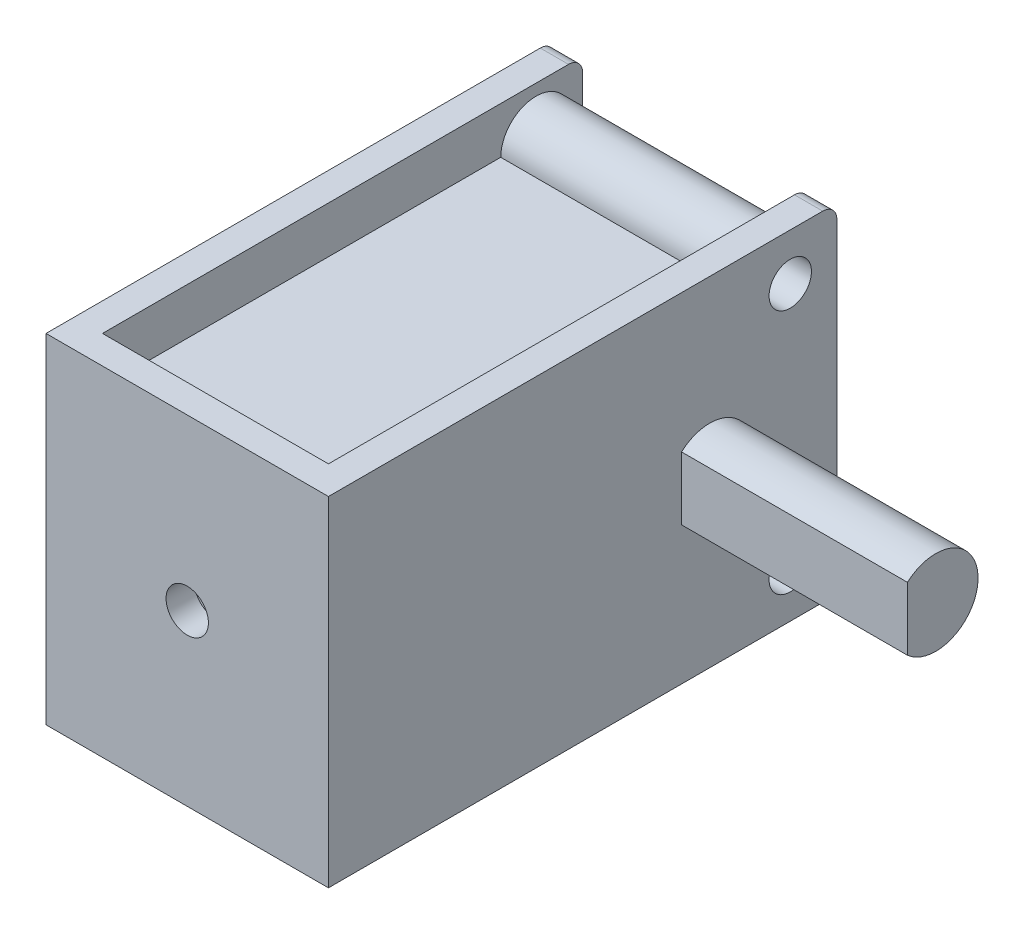
ISO-10303-21;
HEADER;
FILE_DESCRIPTION(('STEP AP214'),'2;1');
FILE_NAME('part.step','',(''),(''),'','','');
FILE_SCHEMA(('AUTOMOTIVE_DESIGN { 1 0 10303 214 1 1 1 1 }'));
ENDSEC;
DATA;
#1=APPLICATION_CONTEXT('core data for automotive mechanical design processes');
#2=APPLICATION_PROTOCOL_DEFINITION('international standard','automotive_design',2000,#1);
#3=PRODUCT_CONTEXT('',#1,'mechanical');
#4=PRODUCT('Part','Part','',(#3));
#5=PRODUCT_RELATED_PRODUCT_CATEGORY('part','',(#4));
#6=PRODUCT_DEFINITION_FORMATION('','',#4);
#7=PRODUCT_DEFINITION_CONTEXT('part definition',#1,'design');
#8=PRODUCT_DEFINITION('design','',#6,#7);
#9=PRODUCT_DEFINITION_SHAPE('','',#8);
#10=(LENGTH_UNIT() NAMED_UNIT(*) SI_UNIT(.MILLI.,.METRE.));
#11=(NAMED_UNIT(*) PLANE_ANGLE_UNIT() SI_UNIT($,.RADIAN.));
#12=(NAMED_UNIT(*) SI_UNIT($,.STERADIAN.) SOLID_ANGLE_UNIT());
#13=UNCERTAINTY_MEASURE_WITH_UNIT(LENGTH_MEASURE(1.E-05),#10,'distance_accuracy_value','');
#14=(GEOMETRIC_REPRESENTATION_CONTEXT(3) GLOBAL_UNCERTAINTY_ASSIGNED_CONTEXT((#13)) GLOBAL_UNIT_ASSIGNED_CONTEXT((#10,
#11,#12)) REPRESENTATION_CONTEXT('',''));
#15=CARTESIAN_POINT('',(0.,0.,0.));
#16=DIRECTION('',(0.,0.,1.));
#17=DIRECTION('',(1.,0.,0.));
#18=AXIS2_PLACEMENT_3D('',#15,#16,#17);
#19=CARTESIAN_POINT('',(4.,-6.,8.));
#20=DIRECTION('',(1.,0.,0.));
#21=DIRECTION('',(0.,0.,-1.));
#22=AXIS2_PLACEMENT_3D('',#19,#20,#21);
#23=PLANE('',#22);
#24=DIRECTION('',(0.,0.,-1.));
#25=VECTOR('',#24,1.);
#26=CARTESIAN_POINT('',(4.,-4.35,8.));
#27=LINE('',#26,#25);
#28=CARTESIAN_POINT('',(4.,-4.35,8.));
#29=VERTEX_POINT('',#28);
#30=CARTESIAN_POINT('',(4.,-4.35,-6.1));
#31=VERTEX_POINT('',#30);
#32=EDGE_CURVE('E726',#29,#31,#27,.T.);
#33=ORIENTED_EDGE('',*,*,#32,.T.);
#34=CARTESIAN_POINT('',(4.,-4.35,-7.35));
#35=DIRECTION('',(1.,0.,0.));
#36=DIRECTION('',(0.,0.,-1.));
#37=AXIS2_PLACEMENT_3D('',#34,#35,#36);
#38=CIRCLE('',#37,1.25);
#39=CARTESIAN_POINT('',(4.,-3.35,-6.6));
#40=VERTEX_POINT('',#39);
#41=EDGE_CURVE('E330',#31,#40,#38,.T.);
#42=ORIENTED_EDGE('',*,*,#41,.T.);
#43=DIRECTION('',(0.,1.,0.));
#44=VECTOR('',#43,1.);
#45=CARTESIAN_POINT('',(4.,4.35,-6.6));
#46=LINE('',#45,#44);
#47=CARTESIAN_POINT('',(4.,3.35,-6.6));
#48=VERTEX_POINT('',#47);
#49=EDGE_CURVE('E77',#40,#48,#46,.T.);
#50=ORIENTED_EDGE('',*,*,#49,.T.);
#51=CARTESIAN_POINT('',(4.,4.35,-7.35));
#52=DIRECTION('',(1.,0.,0.));
#53=DIRECTION('',(0.,0.,-1.));
#54=AXIS2_PLACEMENT_3D('',#51,#52,#53);
#55=CIRCLE('',#54,1.25);
#56=CARTESIAN_POINT('',(4.,4.35,-6.1));
#57=VERTEX_POINT('',#56);
#58=EDGE_CURVE('E329',#48,#57,#55,.T.);
#59=ORIENTED_EDGE('',*,*,#58,.T.);
#60=DIRECTION('',(0.,0.,1.));
#61=VECTOR('',#60,1.);
#62=CARTESIAN_POINT('',(4.,4.35,8.));
#63=LINE('',#62,#61);
#64=CARTESIAN_POINT('',(4.,4.35,8.));
#65=VERTEX_POINT('',#64);
#66=EDGE_CURVE('E69',#57,#65,#63,.T.);
#67=ORIENTED_EDGE('',*,*,#66,.T.);
#68=DIRECTION('',(0.,1.,0.));
#69=VECTOR('',#68,1.);
#70=CARTESIAN_POINT('',(4.,-6.,8.));
#71=LINE('',#70,#69);
#72=CARTESIAN_POINT('',(4.,6.,8.));
#73=VERTEX_POINT('',#72);
#74=EDGE_CURVE('E206',#65,#73,#71,.T.);
#75=ORIENTED_EDGE('',*,*,#74,.T.);
#76=DIRECTION('',(0.,0.,-1.));
#77=VECTOR('',#76,1.);
#78=CARTESIAN_POINT('',(4.,6.,8.));
#79=LINE('',#78,#77);
#80=CARTESIAN_POINT('',(4.,6.,-8.5));
#81=VERTEX_POINT('',#80);
#82=EDGE_CURVE('E353',#73,#81,#79,.T.);
#83=ORIENTED_EDGE('',*,*,#82,.T.);
#84=CARTESIAN_POINT('',(4.,5.5,-8.5));
#85=DIRECTION('',(1.,0.,0.));
#86=DIRECTION('',(0.,0.,-1.));
#87=AXIS2_PLACEMENT_3D('',#84,#85,#86);
#88=CIRCLE('',#87,0.5);
#89=CARTESIAN_POINT('',(4.,5.5,-9.));
#90=VERTEX_POINT('',#89);
#91=EDGE_CURVE('E11',#81,#90,#88,.F.);
#92=ORIENTED_EDGE('',*,*,#91,.T.);
#93=DIRECTION('',(0.,1.,0.));
#94=VECTOR('',#93,1.);
#95=CARTESIAN_POINT('',(4.,-6.,-9.));
#96=LINE('',#95,#94);
#97=CARTESIAN_POINT('',(4.,-5.5,-9.));
#98=VERTEX_POINT('',#97);
#99=EDGE_CURVE('E232',#98,#90,#96,.T.);
#100=ORIENTED_EDGE('',*,*,#99,.F.);
#101=CARTESIAN_POINT('',(4.,-5.5,-8.5));
#102=DIRECTION('',(1.,0.,0.));
#103=DIRECTION('',(0.,0.,-1.));
#104=AXIS2_PLACEMENT_3D('',#101,#102,#103);
#105=CIRCLE('',#104,0.5);
#106=CARTESIAN_POINT('',(4.,-6.,-8.5));
#107=VERTEX_POINT('',#106);
#108=EDGE_CURVE('E231',#98,#107,#105,.F.);
#109=ORIENTED_EDGE('',*,*,#108,.T.);
#110=DIRECTION('',(0.,0.,-1.));
#111=VECTOR('',#110,1.);
#112=CARTESIAN_POINT('',(4.,-6.,8.));
#113=LINE('',#112,#111);
#114=CARTESIAN_POINT('',(4.,-6.,8.));
#115=VERTEX_POINT('',#114);
#116=EDGE_CURVE('E222',#115,#107,#113,.T.);
#117=ORIENTED_EDGE('',*,*,#116,.F.);
#118=EDGE_CURVE('E225',#115,#29,#71,.T.);
#119=ORIENTED_EDGE('',*,*,#118,.T.);
#120=EDGE_LOOP('',(#33,#42,#50,#59,#67,#75,#83,#92,#100,#109,#117,#119));
#121=FACE_BOUND('',#120,.T.);
#122=ADVANCED_FACE('F51',(#121),#23,.F.);
#123=CARTESIAN_POINT('',(-4.,-6.,8.));
#124=DIRECTION('',(0.,0.,1.));
#125=DIRECTION('',(1.,0.,0.));
#126=AXIS2_PLACEMENT_3D('',#123,#124,#125);
#127=PLANE('',#126);
#128=DIRECTION('',(-1.,0.,0.));
#129=VECTOR('',#128,1.);
#130=CARTESIAN_POINT('',(13.002,-4.35,8.));
#131=LINE('',#130,#129);
#132=CARTESIAN_POINT('',(-4.,-4.35,8.));
#133=VERTEX_POINT('',#132);
#134=EDGE_CURVE('E208',#29,#133,#131,.T.);
#135=ORIENTED_EDGE('',*,*,#134,.F.);
#136=ORIENTED_EDGE('',*,*,#118,.F.);
#137=DIRECTION('',(1.,0.,0.));
#138=VECTOR('',#137,1.);
#139=CARTESIAN_POINT('',(-4.,-6.,8.));
#140=LINE('',#139,#138);
#141=CARTESIAN_POINT('',(-4.,-6.,8.));
#142=VERTEX_POINT('',#141);
#143=EDGE_CURVE('E352',#142,#115,#140,.T.);
#144=ORIENTED_EDGE('',*,*,#143,.F.);
#145=DIRECTION('',(0.,1.,0.));
#146=VECTOR('',#145,1.);
#147=CARTESIAN_POINT('',(-4.,-6.,8.));
#148=LINE('',#147,#146);
#149=EDGE_CURVE('E216',#142,#133,#148,.T.);
#150=ORIENTED_EDGE('',*,*,#149,.T.);
#151=EDGE_LOOP('',(#135,#136,#144,#150));
#152=FACE_BOUND('',#151,.T.);
#153=ADVANCED_FACE('F441',(#152),#127,.F.);
#154=DIRECTION('',(-1.,0.,0.));
#155=VECTOR('',#154,1.);
#156=CARTESIAN_POINT('',(13.002,4.35,8.));
#157=LINE('',#156,#155);
#158=CARTESIAN_POINT('',(-4.,4.35,8.));
#159=VERTEX_POINT('',#158);
#160=EDGE_CURVE('E191',#65,#159,#157,.T.);
#161=ORIENTED_EDGE('',*,*,#160,.T.);
#162=CARTESIAN_POINT('',(-4.,6.,8.));
#163=VERTEX_POINT('',#162);
#164=EDGE_CURVE('E204',#159,#163,#148,.T.);
#165=ORIENTED_EDGE('',*,*,#164,.T.);
#166=DIRECTION('',(1.,0.,0.));
#167=VECTOR('',#166,1.);
#168=CARTESIAN_POINT('',(-4.,6.,8.));
#169=LINE('',#168,#167);
#170=EDGE_CURVE('E362',#163,#73,#169,.T.);
#171=ORIENTED_EDGE('',*,*,#170,.T.);
#172=ORIENTED_EDGE('',*,*,#74,.F.);
#173=EDGE_LOOP('',(#161,#165,#171,#172));
#174=FACE_BOUND('',#173,.T.);
#175=ADVANCED_FACE('F202',(#174),#127,.F.);
#176=CARTESIAN_POINT('',(-4.,-6.,-9.));
#177=DIRECTION('',(-1.,0.,0.));
#178=DIRECTION('',(0.,0.,1.));
#179=AXIS2_PLACEMENT_3D('',#176,#177,#178);
#180=PLANE('',#179);
#181=DIRECTION('',(0.,0.,-1.));
#182=VECTOR('',#181,1.);
#183=CARTESIAN_POINT('',(-4.,-4.35,8.));
#184=LINE('',#183,#182);
#185=CARTESIAN_POINT('',(-4.,-4.35,-6.1));
#186=VERTEX_POINT('',#185);
#187=EDGE_CURVE('E747',#133,#186,#184,.T.);
#188=ORIENTED_EDGE('',*,*,#187,.F.);
#189=ORIENTED_EDGE('',*,*,#149,.F.);
#190=DIRECTION('',(0.,0.,1.));
#191=VECTOR('',#190,1.);
#192=CARTESIAN_POINT('',(-4.,-6.,-9.));
#193=LINE('',#192,#191);
#194=CARTESIAN_POINT('',(-4.,-6.,-8.5));
#195=VERTEX_POINT('',#194);
#196=EDGE_CURVE('E348',#195,#142,#193,.T.);
#197=ORIENTED_EDGE('',*,*,#196,.F.);
#198=CARTESIAN_POINT('',(-4.,-5.5,-8.5));
#199=DIRECTION('',(-1.,0.,0.));
#200=DIRECTION('',(0.,0.,1.));
#201=AXIS2_PLACEMENT_3D('',#198,#199,#200);
#202=CIRCLE('',#201,0.5);
#203=CARTESIAN_POINT('',(-4.,-5.5,-9.));
#204=VERTEX_POINT('',#203);
#205=EDGE_CURVE('E228',#195,#204,#202,.F.);
#206=ORIENTED_EDGE('',*,*,#205,.T.);
#207=DIRECTION('',(0.,1.,0.));
#208=VECTOR('',#207,1.);
#209=CARTESIAN_POINT('',(-4.,-6.,-9.));
#210=LINE('',#209,#208);
#211=CARTESIAN_POINT('',(-4.,5.5,-9.));
#212=VERTEX_POINT('',#211);
#213=EDGE_CURVE('E217',#204,#212,#210,.T.);
#214=ORIENTED_EDGE('',*,*,#213,.T.);
#215=CARTESIAN_POINT('',(-4.,5.5,-8.5));
#216=DIRECTION('',(-1.,0.,0.));
#217=DIRECTION('',(0.,0.,1.));
#218=AXIS2_PLACEMENT_3D('',#215,#216,#217);
#219=CIRCLE('',#218,0.5);
#220=CARTESIAN_POINT('',(-4.,6.,-8.5));
#221=VERTEX_POINT('',#220);
#222=EDGE_CURVE('E61',#212,#221,#219,.F.);
#223=ORIENTED_EDGE('',*,*,#222,.T.);
#224=DIRECTION('',(0.,0.,1.));
#225=VECTOR('',#224,1.);
#226=CARTESIAN_POINT('',(-4.,6.,-9.));
#227=LINE('',#226,#225);
#228=EDGE_CURVE('E213',#221,#163,#227,.T.);
#229=ORIENTED_EDGE('',*,*,#228,.T.);
#230=ORIENTED_EDGE('',*,*,#164,.F.);
#231=DIRECTION('',(0.,0.,1.));
#232=VECTOR('',#231,1.);
#233=CARTESIAN_POINT('',(-4.,4.35,8.));
#234=LINE('',#233,#232);
#235=CARTESIAN_POINT('',(-4.,4.35,-6.1));
#236=VERTEX_POINT('',#235);
#237=EDGE_CURVE('E188',#236,#159,#234,.T.);
#238=ORIENTED_EDGE('',*,*,#237,.F.);
#239=CARTESIAN_POINT('',(-4.,4.35,-7.35));
#240=DIRECTION('',(-1.,0.,0.));
#241=DIRECTION('',(0.,0.,1.));
#242=AXIS2_PLACEMENT_3D('',#239,#240,#241);
#243=CIRCLE('',#242,1.25);
#244=CARTESIAN_POINT('',(-4.,3.35,-6.6));
#245=VERTEX_POINT('',#244);
#246=EDGE_CURVE('E327',#236,#245,#243,.T.);
#247=ORIENTED_EDGE('',*,*,#246,.T.);
#248=DIRECTION('',(0.,1.,0.));
#249=VECTOR('',#248,1.);
#250=CARTESIAN_POINT('',(-4.,4.35,-6.6));
#251=LINE('',#250,#249);
#252=CARTESIAN_POINT('',(-4.,-3.35,-6.6));
#253=VERTEX_POINT('',#252);
#254=EDGE_CURVE('E198',#253,#245,#251,.T.);
#255=ORIENTED_EDGE('',*,*,#254,.F.);
#256=CARTESIAN_POINT('',(-4.,-4.35,-7.35));
#257=DIRECTION('',(-1.,0.,0.));
#258=DIRECTION('',(0.,0.,1.));
#259=AXIS2_PLACEMENT_3D('',#256,#257,#258);
#260=CIRCLE('',#259,1.25);
#261=EDGE_CURVE('E55',#253,#186,#260,.T.);
#262=ORIENTED_EDGE('',*,*,#261,.T.);
#263=EDGE_LOOP('',(#188,#189,#197,#206,#214,#223,#229,#230,#238,#247,#255,#262));
#264=FACE_BOUND('',#263,.T.);
#265=ADVANCED_FACE('F211',(#264),#180,.F.);
#266=CARTESIAN_POINT('',(-5.,4.35,-7.35));
#267=DIRECTION('',(1.,0.,0.));
#268=DIRECTION('',(0.,0.,-1.));
#269=AXIS2_PLACEMENT_3D('',#266,#267,#268);
#270=CYLINDRICAL_SURFACE('',#269,1.25);
#271=ORIENTED_EDGE('',*,*,#58,.F.);
#272=DIRECTION('',(1.,0.,0.));
#273=VECTOR('',#272,1.);
#274=CARTESIAN_POINT('',(-5.,3.35,-6.6));
#275=LINE('',#274,#273);
#276=EDGE_CURVE('E732',#245,#48,#275,.T.);
#277=ORIENTED_EDGE('',*,*,#276,.F.);
#278=ORIENTED_EDGE('',*,*,#246,.F.);
#279=DIRECTION('',(1.,0.,0.));
#280=VECTOR('',#279,1.);
#281=CARTESIAN_POINT('',(-5.,4.35,-6.1));
#282=LINE('',#281,#280);
#283=EDGE_CURVE('E192',#57,#236,#282,.F.);
#284=ORIENTED_EDGE('',*,*,#283,.F.);
#285=EDGE_LOOP('',(#271,#277,#278,#284));
#286=FACE_BOUND('',#285,.T.);
#287=ADVANCED_FACE('F449',(#286),#270,.T.);
#288=CARTESIAN_POINT('',(-5.,-4.35,-7.35));
#289=DIRECTION('',(1.,0.,0.));
#290=DIRECTION('',(0.,0.,-1.));
#291=AXIS2_PLACEMENT_3D('',#288,#289,#290);
#292=CYLINDRICAL_SURFACE('',#291,1.25);
#293=ORIENTED_EDGE('',*,*,#41,.F.);
#294=DIRECTION('',(1.,0.,0.));
#295=VECTOR('',#294,1.);
#296=CARTESIAN_POINT('',(-5.,-4.35,-6.1));
#297=LINE('',#296,#295);
#298=EDGE_CURVE('E729',#186,#31,#297,.T.);
#299=ORIENTED_EDGE('',*,*,#298,.F.);
#300=ORIENTED_EDGE('',*,*,#261,.F.);
#301=DIRECTION('',(1.,0.,0.));
#302=VECTOR('',#301,1.);
#303=CARTESIAN_POINT('',(-5.,-3.35,-6.6));
#304=LINE('',#303,#302);
#305=EDGE_CURVE('E735',#40,#253,#304,.F.);
#306=ORIENTED_EDGE('',*,*,#305,.F.);
#307=EDGE_LOOP('',(#293,#299,#300,#306));
#308=FACE_BOUND('',#307,.T.);
#309=ADVANCED_FACE('F548',(#308),#292,.T.);
#310=CARTESIAN_POINT('',(-5.,6.,-9.));
#311=DIRECTION('',(0.,0.,1.));
#312=DIRECTION('',(1.,0.,0.));
#313=AXIS2_PLACEMENT_3D('',#310,#311,#312);
#314=PLANE('',#313);
#315=DIRECTION('',(-1.,0.,0.));
#316=VECTOR('',#315,1.);
#317=CARTESIAN_POINT('',(-5.,-5.5,-9.));
#318=LINE('',#317,#316);
#319=CARTESIAN_POINT('',(5.,-5.5,-9.));
#320=VERTEX_POINT('',#319);
#321=EDGE_CURVE('E300',#320,#98,#318,.T.);
#322=ORIENTED_EDGE('',*,*,#321,.T.);
#323=ORIENTED_EDGE('',*,*,#99,.T.);
#324=DIRECTION('',(-1.,0.,0.));
#325=VECTOR('',#324,1.);
#326=CARTESIAN_POINT('',(-5.,5.5,-9.));
#327=LINE('',#326,#325);
#328=CARTESIAN_POINT('',(5.,5.5,-9.));
#329=VERTEX_POINT('',#328);
#330=EDGE_CURVE('E294',#90,#329,#327,.F.);
#331=ORIENTED_EDGE('',*,*,#330,.T.);
#332=DIRECTION('',(0.,-1.,0.));
#333=VECTOR('',#332,1.);
#334=CARTESIAN_POINT('',(5.,6.,-9.));
#335=LINE('',#334,#333);
#336=EDGE_CURVE('E290',#329,#320,#335,.T.);
#337=ORIENTED_EDGE('',*,*,#336,.T.);
#338=EDGE_LOOP('',(#322,#323,#331,#337));
#339=FACE_BOUND('',#338,.T.);
#340=ADVANCED_FACE('F389',(#339),#314,.F.);
#341=CARTESIAN_POINT('',(-5.,-5.5,-8.5));
#342=DIRECTION('',(1.,0.,0.));
#343=DIRECTION('',(0.,0.,-1.));
#344=AXIS2_PLACEMENT_3D('',#341,#342,#343);
#345=CYLINDRICAL_SURFACE('',#344,0.5);
#346=ORIENTED_EDGE('',*,*,#108,.F.);
#347=ORIENTED_EDGE('',*,*,#321,.F.);
#348=CARTESIAN_POINT('',(5.,-5.5,-8.5));
#349=DIRECTION('',(-1.,0.,0.));
#350=DIRECTION('',(0.,0.,1.));
#351=AXIS2_PLACEMENT_3D('',#348,#349,#350);
#352=CIRCLE('',#351,0.5);
#353=CARTESIAN_POINT('',(5.,-6.,-8.5));
#354=VERTEX_POINT('',#353);
#355=EDGE_CURVE('E318',#354,#320,#352,.F.);
#356=ORIENTED_EDGE('',*,*,#355,.F.);
#357=DIRECTION('',(-1.,0.,0.));
#358=VECTOR('',#357,1.);
#359=CARTESIAN_POINT('',(5.,-6.,-8.5));
#360=LINE('',#359,#358);
#361=EDGE_CURVE('E310',#107,#354,#360,.F.);
#362=ORIENTED_EDGE('',*,*,#361,.F.);
#363=EDGE_LOOP('',(#346,#347,#356,#362));
#364=FACE_BOUND('',#363,.T.);
#365=ADVANCED_FACE('F387',(#364),#345,.T.);
#366=CARTESIAN_POINT('',(0.,5.5,-8.5));
#367=DIRECTION('',(-1.,0.,0.));
#368=DIRECTION('',(0.,0.,1.));
#369=AXIS2_PLACEMENT_3D('',#366,#367,#368);
#370=CYLINDRICAL_SURFACE('',#369,0.5);
#371=ORIENTED_EDGE('',*,*,#91,.F.);
#372=DIRECTION('',(-1.,0.,0.));
#373=VECTOR('',#372,1.);
#374=CARTESIAN_POINT('',(0.,6.,-8.5));
#375=LINE('',#374,#373);
#376=CARTESIAN_POINT('',(5.,6.,-8.5));
#377=VERTEX_POINT('',#376);
#378=EDGE_CURVE('E322',#377,#81,#375,.T.);
#379=ORIENTED_EDGE('',*,*,#378,.F.);
#380=CARTESIAN_POINT('',(5.,5.5,-8.5));
#381=DIRECTION('',(-1.,0.,0.));
#382=DIRECTION('',(0.,0.,1.));
#383=AXIS2_PLACEMENT_3D('',#380,#381,#382);
#384=CIRCLE('',#383,0.5);
#385=EDGE_CURVE('E315',#329,#377,#384,.F.);
#386=ORIENTED_EDGE('',*,*,#385,.F.);
#387=ORIENTED_EDGE('',*,*,#330,.F.);
#388=EDGE_LOOP('',(#371,#379,#386,#387));
#389=FACE_BOUND('',#388,.T.);
#390=ADVANCED_FACE('F382',(#389),#370,.T.);
#391=CARTESIAN_POINT('',(5.,6.,9.));
#392=DIRECTION('',(-1.,0.,0.));
#393=DIRECTION('',(0.,0.,1.));
#394=AXIS2_PLACEMENT_3D('',#391,#392,#393);
#395=PLANE('',#394);
#396=CARTESIAN_POINT('',(5.,4.35,-7.35));
#397=DIRECTION('',(1.,0.,0.));
#398=DIRECTION('',(0.,0.,-1.));
#399=AXIS2_PLACEMENT_3D('',#396,#397,#398);
#400=CIRCLE('',#399,0.749999999999999);
#401=CARTESIAN_POINT('',(5.,4.35,-8.1));
#402=VERTEX_POINT('',#401);
#403=EDGE_CURVE('E709',#402,#402,#400,.T.);
#404=ORIENTED_EDGE('',*,*,#403,.F.);
#405=EDGE_LOOP('',(#404));
#406=FACE_BOUND('',#405,.T.);
#407=CARTESIAN_POINT('',(5.,-4.35,-7.35));
#408=DIRECTION('',(1.,0.,0.));
#409=DIRECTION('',(0.,0.,1.));
#410=AXIS2_PLACEMENT_3D('',#407,#408,#409);
#411=CIRCLE('',#410,0.749999999999999);
#412=CARTESIAN_POINT('',(5.,-4.35,-6.6));
#413=VERTEX_POINT('',#412);
#414=EDGE_CURVE('E345',#413,#413,#411,.T.);
#415=ORIENTED_EDGE('',*,*,#414,.F.);
#416=EDGE_LOOP('',(#415));
#417=FACE_BOUND('',#416,.T.);
#418=DIRECTION('',(0.,0.,-1.));
#419=VECTOR('',#418,1.);
#420=CARTESIAN_POINT('',(5.,-6.,9.));
#421=LINE('',#420,#419);
#422=CARTESIAN_POINT('',(5.,-6.,9.));
#423=VERTEX_POINT('',#422);
#424=EDGE_CURVE('E258',#423,#354,#421,.T.);
#425=ORIENTED_EDGE('',*,*,#424,.T.);
#426=ORIENTED_EDGE('',*,*,#355,.T.);
#427=ORIENTED_EDGE('',*,*,#336,.F.);
#428=ORIENTED_EDGE('',*,*,#385,.T.);
#429=DIRECTION('',(0.,0.,-1.));
#430=VECTOR('',#429,1.);
#431=CARTESIAN_POINT('',(5.,6.,9.));
#432=LINE('',#431,#430);
#433=CARTESIAN_POINT('',(5.,6.,9.));
#434=VERTEX_POINT('',#433);
#435=EDGE_CURVE('E259',#434,#377,#432,.T.);
#436=ORIENTED_EDGE('',*,*,#435,.F.);
#437=DIRECTION('',(0.,-1.,0.));
#438=VECTOR('',#437,1.);
#439=CARTESIAN_POINT('',(5.,6.,9.));
#440=LINE('',#439,#438);
#441=EDGE_CURVE('E270',#434,#423,#440,.T.);
#442=ORIENTED_EDGE('',*,*,#441,.T.);
#443=EDGE_LOOP('',(#425,#426,#427,#428,#436,#442));
#444=FACE_BOUND('',#443,.T.);
#445=CARTESIAN_POINT('',(5.,0.,-4.5));
#446=DIRECTION('',(1.,0.,0.));
#447=DIRECTION('',(0.,0.,-1.));
#448=AXIS2_PLACEMENT_3D('',#445,#446,#447);
#449=CIRCLE('',#448,1.5);
#450=CARTESIAN_POINT('',(5.,-1.11803398874989,-3.5));
#451=VERTEX_POINT('',#450);
#452=CARTESIAN_POINT('',(5.,1.1180339887499,-3.5));
#453=VERTEX_POINT('',#452);
#454=EDGE_CURVE('E235',#451,#453,#449,.T.);
#455=ORIENTED_EDGE('',*,*,#454,.F.);
#456=DIRECTION('',(0.,-1.,0.));
#457=VECTOR('',#456,1.);
#458=CARTESIAN_POINT('',(5.,1.11803398874989,-3.5));
#459=LINE('',#458,#457);
#460=EDGE_CURVE('E241',#453,#451,#459,.T.);
#461=ORIENTED_EDGE('',*,*,#460,.F.);
#462=EDGE_LOOP('',(#455,#461));
#463=FACE_BOUND('',#462,.T.);
#464=ADVANCED_FACE('F392',(#406,#417,#444,#463),#395,.F.);
#465=CARTESIAN_POINT('',(-5.,5.5,-9.));
#466=VERTEX_POINT('',#465);
#467=EDGE_CURVE('E295',#466,#212,#327,.F.);
#468=ORIENTED_EDGE('',*,*,#467,.T.);
#469=ORIENTED_EDGE('',*,*,#213,.F.);
#470=CARTESIAN_POINT('',(-5.,-5.5,-9.));
#471=VERTEX_POINT('',#470);
#472=EDGE_CURVE('E299',#204,#471,#318,.T.);
#473=ORIENTED_EDGE('',*,*,#472,.T.);
#474=DIRECTION('',(0.,-1.,0.));
#475=VECTOR('',#474,1.);
#476=CARTESIAN_POINT('',(-5.,6.,-9.));
#477=LINE('',#476,#475);
#478=EDGE_CURVE('E286',#466,#471,#477,.T.);
#479=ORIENTED_EDGE('',*,*,#478,.F.);
#480=EDGE_LOOP('',(#468,#469,#473,#479));
#481=FACE_BOUND('',#480,.T.);
#482=ADVANCED_FACE('F408',(#481),#314,.F.);
#483=CARTESIAN_POINT('',(-5.,6.,9.));
#484=DIRECTION('',(1.,0.,0.));
#485=DIRECTION('',(0.,0.,-1.));
#486=AXIS2_PLACEMENT_3D('',#483,#484,#485);
#487=PLANE('',#486);
#488=CARTESIAN_POINT('',(-5.,4.35,-7.35));
#489=DIRECTION('',(1.,0.,0.));
#490=DIRECTION('',(0.,0.,-1.));
#491=AXIS2_PLACEMENT_3D('',#488,#489,#490);
#492=CIRCLE('',#491,0.749999999999999);
#493=CARTESIAN_POINT('',(-5.,4.35,-8.1));
#494=VERTEX_POINT('',#493);
#495=EDGE_CURVE('E343',#494,#494,#492,.T.);
#496=ORIENTED_EDGE('',*,*,#495,.T.);
#497=EDGE_LOOP('',(#496));
#498=FACE_BOUND('',#497,.T.);
#499=CARTESIAN_POINT('',(-5.,-4.35,-7.35));
#500=DIRECTION('',(1.,0.,0.));
#501=DIRECTION('',(0.,0.,1.));
#502=AXIS2_PLACEMENT_3D('',#499,#500,#501);
#503=CIRCLE('',#502,0.749999999999999);
#504=CARTESIAN_POINT('',(-5.,-4.35,-6.6));
#505=VERTEX_POINT('',#504);
#506=EDGE_CURVE('E701',#505,#505,#503,.T.);
#507=ORIENTED_EDGE('',*,*,#506,.T.);
#508=EDGE_LOOP('',(#507));
#509=FACE_BOUND('',#508,.T.);
#510=ORIENTED_EDGE('',*,*,#478,.T.);
#511=CARTESIAN_POINT('',(-5.,-5.5,-8.5));
#512=DIRECTION('',(1.,0.,0.));
#513=DIRECTION('',(0.,0.,-1.));
#514=AXIS2_PLACEMENT_3D('',#511,#512,#513);
#515=CIRCLE('',#514,0.5);
#516=CARTESIAN_POINT('',(-5.,-6.,-8.5));
#517=VERTEX_POINT('',#516);
#518=EDGE_CURVE('E307',#471,#517,#515,.F.);
#519=ORIENTED_EDGE('',*,*,#518,.T.);
#520=DIRECTION('',(0.,0.,1.));
#521=VECTOR('',#520,1.);
#522=CARTESIAN_POINT('',(-5.,-6.,9.));
#523=LINE('',#522,#521);
#524=CARTESIAN_POINT('',(-5.,-6.,9.));
#525=VERTEX_POINT('',#524);
#526=EDGE_CURVE('E274',#517,#525,#523,.T.);
#527=ORIENTED_EDGE('',*,*,#526,.T.);
#528=DIRECTION('',(0.,-1.,0.));
#529=VECTOR('',#528,1.);
#530=CARTESIAN_POINT('',(-5.,6.,9.));
#531=LINE('',#530,#529);
#532=CARTESIAN_POINT('',(-5.,6.,9.));
#533=VERTEX_POINT('',#532);
#534=EDGE_CURVE('E282',#533,#525,#531,.T.);
#535=ORIENTED_EDGE('',*,*,#534,.F.);
#536=DIRECTION('',(0.,0.,1.));
#537=VECTOR('',#536,1.);
#538=CARTESIAN_POINT('',(-5.,6.,9.));
#539=LINE('',#538,#537);
#540=CARTESIAN_POINT('',(-5.,6.,-8.5));
#541=VERTEX_POINT('',#540);
#542=EDGE_CURVE('E263',#541,#533,#539,.T.);
#543=ORIENTED_EDGE('',*,*,#542,.F.);
#544=CARTESIAN_POINT('',(-5.,5.5,-8.5));
#545=DIRECTION('',(1.,0.,0.));
#546=DIRECTION('',(0.,0.,-1.));
#547=AXIS2_PLACEMENT_3D('',#544,#545,#546);
#548=CIRCLE('',#547,0.5);
#549=EDGE_CURVE('E304',#541,#466,#548,.F.);
#550=ORIENTED_EDGE('',*,*,#549,.T.);
#551=EDGE_LOOP('',(#510,#519,#527,#535,#543,#550));
#552=FACE_BOUND('',#551,.T.);
#553=ADVANCED_FACE('F415',(#498,#509,#552),#487,.F.);
#554=CARTESIAN_POINT('',(-5.,6.,9.));
#555=DIRECTION('',(0.,0.,-1.));
#556=DIRECTION('',(-1.,0.,0.));
#557=AXIS2_PLACEMENT_3D('',#554,#555,#556);
#558=PLANE('',#557);
#559=CARTESIAN_POINT('',(0.,0.,9.));
#560=DIRECTION('',(0.,0.,1.));
#561=DIRECTION('',(1.,0.,0.));
#562=AXIS2_PLACEMENT_3D('',#559,#560,#561);
#563=CIRCLE('',#562,0.75);
#564=CARTESIAN_POINT('',(0.75,0.,9.));
#565=VERTEX_POINT('',#564);
#566=EDGE_CURVE('E706',#565,#565,#563,.T.);
#567=ORIENTED_EDGE('',*,*,#566,.F.);
#568=EDGE_LOOP('',(#567));
#569=FACE_BOUND('',#568,.T.);
#570=DIRECTION('',(1.,0.,0.));
#571=VECTOR('',#570,1.);
#572=CARTESIAN_POINT('',(-5.,-6.,9.));
#573=LINE('',#572,#571);
#574=EDGE_CURVE('E264',#525,#423,#573,.T.);
#575=ORIENTED_EDGE('',*,*,#574,.T.);
#576=ORIENTED_EDGE('',*,*,#441,.F.);
#577=DIRECTION('',(1.,0.,0.));
#578=VECTOR('',#577,1.);
#579=CARTESIAN_POINT('',(-5.,6.,9.));
#580=LINE('',#579,#578);
#581=EDGE_CURVE('E267',#533,#434,#580,.T.);
#582=ORIENTED_EDGE('',*,*,#581,.F.);
#583=ORIENTED_EDGE('',*,*,#534,.T.);
#584=EDGE_LOOP('',(#575,#576,#582,#583));
#585=FACE_BOUND('',#584,.T.);
#586=ADVANCED_FACE('F425',(#569,#585),#558,.F.);
#587=CARTESIAN_POINT('',(0.,6.,0.));
#588=DIRECTION('',(0.,-1.,0.));
#589=DIRECTION('',(0.,0.,-1.));
#590=AXIS2_PLACEMENT_3D('',#587,#588,#589);
#591=PLANE('',#590);
#592=ORIENTED_EDGE('',*,*,#378,.T.);
#593=ORIENTED_EDGE('',*,*,#82,.F.);
#594=ORIENTED_EDGE('',*,*,#170,.F.);
#595=ORIENTED_EDGE('',*,*,#228,.F.);
#596=EDGE_CURVE('E321',#221,#541,#375,.T.);
#597=ORIENTED_EDGE('',*,*,#596,.T.);
#598=ORIENTED_EDGE('',*,*,#542,.T.);
#599=ORIENTED_EDGE('',*,*,#581,.T.);
#600=ORIENTED_EDGE('',*,*,#435,.T.);
#601=EDGE_LOOP('',(#592,#593,#594,#595,#597,#598,#599,#600));
#602=FACE_BOUND('',#601,.T.);
#603=ADVANCED_FACE('F377',(#602),#591,.F.);
#604=CARTESIAN_POINT('',(0.,-6.,0.));
#605=DIRECTION('',(0.,-1.,0.));
#606=DIRECTION('',(0.,0.,-1.));
#607=AXIS2_PLACEMENT_3D('',#604,#605,#606);
#608=PLANE('',#607);
#609=ORIENTED_EDGE('',*,*,#116,.T.);
#610=ORIENTED_EDGE('',*,*,#361,.T.);
#611=ORIENTED_EDGE('',*,*,#424,.F.);
#612=ORIENTED_EDGE('',*,*,#574,.F.);
#613=ORIENTED_EDGE('',*,*,#526,.F.);
#614=EDGE_CURVE('E311',#517,#195,#360,.F.);
#615=ORIENTED_EDGE('',*,*,#614,.T.);
#616=ORIENTED_EDGE('',*,*,#196,.T.);
#617=ORIENTED_EDGE('',*,*,#143,.T.);
#618=EDGE_LOOP('',(#609,#610,#611,#612,#613,#615,#616,#617));
#619=FACE_BOUND('',#618,.T.);
#620=ADVANCED_FACE('F398',(#619),#608,.T.);
#621=CARTESIAN_POINT('',(13.,0.,-4.5));
#622=DIRECTION('',(-1.,0.,0.));
#623=DIRECTION('',(0.,0.,1.));
#624=AXIS2_PLACEMENT_3D('',#621,#622,#623);
#625=CYLINDRICAL_SURFACE('',#624,1.5);
#626=ORIENTED_EDGE('',*,*,#454,.T.);
#627=DIRECTION('',(-1.,0.,0.));
#628=VECTOR('',#627,1.);
#629=CARTESIAN_POINT('',(13.,1.11803398874989,-3.5));
#630=LINE('',#629,#628);
#631=CARTESIAN_POINT('',(13.,1.11803398874989,-3.5));
#632=VERTEX_POINT('',#631);
#633=EDGE_CURVE('E254',#632,#453,#630,.T.);
#634=ORIENTED_EDGE('',*,*,#633,.F.);
#635=CARTESIAN_POINT('',(13.,0.,-4.5));
#636=DIRECTION('',(1.,0.,0.));
#637=DIRECTION('',(0.,0.,-1.));
#638=AXIS2_PLACEMENT_3D('',#635,#636,#637);
#639=CIRCLE('',#638,1.5);
#640=CARTESIAN_POINT('',(13.,-1.11803398874989,-3.5));
#641=VERTEX_POINT('',#640);
#642=EDGE_CURVE('E236',#641,#632,#639,.T.);
#643=ORIENTED_EDGE('',*,*,#642,.F.);
#644=DIRECTION('',(-1.,0.,0.));
#645=VECTOR('',#644,1.);
#646=CARTESIAN_POINT('',(13.,-1.11803398874989,-3.5));
#647=LINE('',#646,#645);
#648=EDGE_CURVE('E244',#641,#451,#647,.T.);
#649=ORIENTED_EDGE('',*,*,#648,.T.);
#650=EDGE_LOOP('',(#626,#634,#643,#649));
#651=FACE_BOUND('',#650,.T.);
#652=ADVANCED_FACE('F461',(#651),#625,.T.);
#653=CARTESIAN_POINT('',(13.,1.11803398874989,-3.5));
#654=DIRECTION('',(0.,0.,-1.));
#655=DIRECTION('',(-1.,0.,0.));
#656=AXIS2_PLACEMENT_3D('',#653,#654,#655);
#657=PLANE('',#656);
#658=ORIENTED_EDGE('',*,*,#460,.T.);
#659=ORIENTED_EDGE('',*,*,#648,.F.);
#660=DIRECTION('',(0.,-1.,0.));
#661=VECTOR('',#660,1.);
#662=CARTESIAN_POINT('',(13.,1.11803398874989,-3.5));
#663=LINE('',#662,#661);
#664=EDGE_CURVE('E240',#632,#641,#663,.T.);
#665=ORIENTED_EDGE('',*,*,#664,.F.);
#666=ORIENTED_EDGE('',*,*,#633,.T.);
#667=EDGE_LOOP('',(#658,#659,#665,#666));
#668=FACE_BOUND('',#667,.T.);
#669=ADVANCED_FACE('F457',(#668),#657,.F.);
#670=CARTESIAN_POINT('',(13.,0.,-4.5));
#671=DIRECTION('',(1.,0.,0.));
#672=DIRECTION('',(0.,0.,-1.));
#673=AXIS2_PLACEMENT_3D('',#670,#671,#672);
#674=PLANE('',#673);
#675=ORIENTED_EDGE('',*,*,#642,.T.);
#676=ORIENTED_EDGE('',*,*,#664,.T.);
#677=EDGE_LOOP('',(#675,#676));
#678=FACE_BOUND('',#677,.T.);
#679=ADVANCED_FACE('F454',(#678),#674,.T.);
#680=ORIENTED_EDGE('',*,*,#205,.F.);
#681=ORIENTED_EDGE('',*,*,#614,.F.);
#682=ORIENTED_EDGE('',*,*,#518,.F.);
#683=ORIENTED_EDGE('',*,*,#472,.F.);
#684=EDGE_LOOP('',(#680,#681,#682,#683));
#685=FACE_BOUND('',#684,.T.);
#686=ADVANCED_FACE('F413',(#685),#345,.T.);
#687=ORIENTED_EDGE('',*,*,#222,.F.);
#688=ORIENTED_EDGE('',*,*,#467,.F.);
#689=ORIENTED_EDGE('',*,*,#549,.F.);
#690=ORIENTED_EDGE('',*,*,#596,.F.);
#691=EDGE_LOOP('',(#687,#688,#689,#690));
#692=FACE_BOUND('',#691,.T.);
#693=ADVANCED_FACE('F53',(#692),#370,.T.);
#694=CARTESIAN_POINT('',(-5.,-4.35,-7.35));
#695=DIRECTION('',(1.,0.,0.));
#696=DIRECTION('',(0.,0.,-1.));
#697=AXIS2_PLACEMENT_3D('',#694,#695,#696);
#698=CYLINDRICAL_SURFACE('',#697,0.749999999999999);
#699=ORIENTED_EDGE('',*,*,#506,.F.);
#700=EDGE_LOOP('',(#699));
#701=FACE_BOUND('',#700,.T.);
#702=ORIENTED_EDGE('',*,*,#414,.T.);
#703=EDGE_LOOP('',(#702));
#704=FACE_BOUND('',#703,.T.);
#705=ADVANCED_FACE('F489',(#701,#704),#698,.F.);
#706=CARTESIAN_POINT('',(-5.,4.35,-7.35));
#707=DIRECTION('',(1.,0.,0.));
#708=DIRECTION('',(0.,0.,-1.));
#709=AXIS2_PLACEMENT_3D('',#706,#707,#708);
#710=CYLINDRICAL_SURFACE('',#709,0.749999999999999);
#711=ORIENTED_EDGE('',*,*,#495,.F.);
#712=EDGE_LOOP('',(#711));
#713=FACE_BOUND('',#712,.T.);
#714=ORIENTED_EDGE('',*,*,#403,.T.);
#715=EDGE_LOOP('',(#714));
#716=FACE_BOUND('',#715,.T.);
#717=ADVANCED_FACE('F688',(#713,#716),#710,.F.);
#718=CARTESIAN_POINT('',(0.,0.,-9.001));
#719=DIRECTION('',(0.,0.,1.));
#720=DIRECTION('',(1.,0.,0.));
#721=AXIS2_PLACEMENT_3D('',#718,#719,#720);
#722=CYLINDRICAL_SURFACE('',#721,0.75);
#723=ORIENTED_EDGE('',*,*,#566,.T.);
#724=EDGE_LOOP('',(#723));
#725=FACE_BOUND('',#724,.T.);
#726=CARTESIAN_POINT('',(0.,0.,8.));
#727=DIRECTION('',(0.,0.,-1.));
#728=DIRECTION('',(-1.,0.,0.));
#729=AXIS2_PLACEMENT_3D('',#726,#727,#728);
#730=CIRCLE('',#729,0.75);
#731=CARTESIAN_POINT('',(-0.75,0.,8.));
#732=VERTEX_POINT('',#731);
#733=EDGE_CURVE('E711',#732,#732,#730,.F.);
#734=ORIENTED_EDGE('',*,*,#733,.F.);
#735=EDGE_LOOP('',(#734));
#736=FACE_BOUND('',#735,.T.);
#737=ADVANCED_FACE('F671',(#725,#736),#722,.F.);
#738=CARTESIAN_POINT('',(13.002,4.35,8.));
#739=DIRECTION('',(0.,0.,-1.));
#740=DIRECTION('',(-1.,0.,0.));
#741=AXIS2_PLACEMENT_3D('',#738,#739,#740);
#742=PLANE('',#741);
#743=ORIENTED_EDGE('',*,*,#733,.T.);
#744=EDGE_LOOP('',(#743));
#745=FACE_BOUND('',#744,.T.);
#746=ADVANCED_FACE('F497',(#745),#742,.F.);
#747=CARTESIAN_POINT('',(13.002,4.35,-6.6));
#748=DIRECTION('',(0.,0.,1.));
#749=DIRECTION('',(1.,0.,0.));
#750=AXIS2_PLACEMENT_3D('',#747,#748,#749);
#751=PLANE('',#750);
#752=ORIENTED_EDGE('',*,*,#254,.T.);
#753=ORIENTED_EDGE('',*,*,#276,.T.);
#754=ORIENTED_EDGE('',*,*,#49,.F.);
#755=ORIENTED_EDGE('',*,*,#305,.T.);
#756=EDGE_LOOP('',(#752,#753,#754,#755));
#757=FACE_BOUND('',#756,.T.);
#758=ADVANCED_FACE('F493',(#757),#751,.F.);
#759=CARTESIAN_POINT('',(13.002,-4.35,8.));
#760=DIRECTION('',(0.,1.,0.));
#761=DIRECTION('',(0.,0.,1.));
#762=AXIS2_PLACEMENT_3D('',#759,#760,#761);
#763=PLANE('',#762);
#764=ORIENTED_EDGE('',*,*,#187,.T.);
#765=ORIENTED_EDGE('',*,*,#298,.T.);
#766=ORIENTED_EDGE('',*,*,#32,.F.);
#767=ORIENTED_EDGE('',*,*,#134,.T.);
#768=EDGE_LOOP('',(#764,#765,#766,#767));
#769=FACE_BOUND('',#768,.T.);
#770=ADVANCED_FACE('F496',(#769),#763,.F.);
#771=CARTESIAN_POINT('',(13.002,4.35,8.));
#772=DIRECTION('',(0.,-1.,0.));
#773=DIRECTION('',(0.,0.,-1.));
#774=AXIS2_PLACEMENT_3D('',#771,#772,#773);
#775=PLANE('',#774);
#776=ORIENTED_EDGE('',*,*,#66,.F.);
#777=ORIENTED_EDGE('',*,*,#283,.T.);
#778=ORIENTED_EDGE('',*,*,#237,.T.);
#779=ORIENTED_EDGE('',*,*,#160,.F.);
#780=EDGE_LOOP('',(#776,#777,#778,#779));
#781=FACE_BOUND('',#780,.T.);
#782=ADVANCED_FACE('F190',(#781),#775,.F.);
#783=CLOSED_SHELL('',(#122,#153,#175,#265,#287,#309,#340,#365,#390,#464,#482,#553,#586,#603,
#620,#652,#669,#679,#686,#693,#705,#717,#737,#746,#758,#770,#782));
#784=MANIFOLD_SOLID_BREP('B2',#783);
#785=ADVANCED_BREP_SHAPE_REPRESENTATION('',(#18,#784),#14);
#786=SHAPE_DEFINITION_REPRESENTATION(#9,#785);
ENDSEC;
END-ISO-10303-21;
